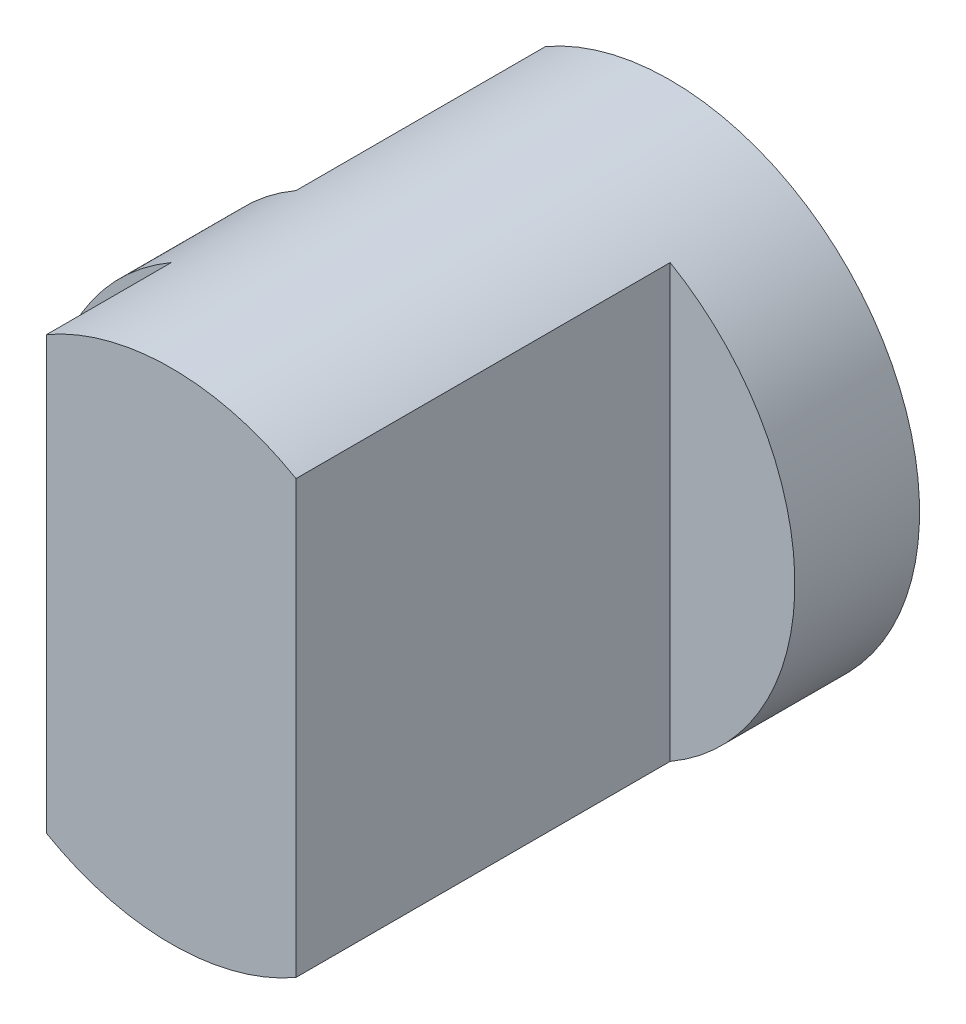
ISO-10303-21;
HEADER;
FILE_DESCRIPTION(('STEP AP214'),'2;1');
FILE_NAME('part.step','',(''),(''),'','','');
FILE_SCHEMA(('AUTOMOTIVE_DESIGN { 1 0 10303 214 1 1 1 1 }'));
ENDSEC;
DATA;
#1=APPLICATION_CONTEXT('core data for automotive mechanical design processes');
#2=APPLICATION_PROTOCOL_DEFINITION('international standard','automotive_design',2000,#1);
#3=PRODUCT_CONTEXT('',#1,'mechanical');
#4=PRODUCT('Part','Part','',(#3));
#5=PRODUCT_RELATED_PRODUCT_CATEGORY('part','',(#4));
#6=PRODUCT_DEFINITION_FORMATION('','',#4);
#7=PRODUCT_DEFINITION_CONTEXT('part definition',#1,'design');
#8=PRODUCT_DEFINITION('design','',#6,#7);
#9=PRODUCT_DEFINITION_SHAPE('','',#8);
#10=(LENGTH_UNIT() NAMED_UNIT(*) SI_UNIT(.MILLI.,.METRE.));
#11=(NAMED_UNIT(*) PLANE_ANGLE_UNIT() SI_UNIT($,.RADIAN.));
#12=(NAMED_UNIT(*) SI_UNIT($,.STERADIAN.) SOLID_ANGLE_UNIT());
#13=UNCERTAINTY_MEASURE_WITH_UNIT(LENGTH_MEASURE(1.E-05),#10,'distance_accuracy_value','');
#14=(GEOMETRIC_REPRESENTATION_CONTEXT(3) GLOBAL_UNCERTAINTY_ASSIGNED_CONTEXT((#13)) GLOBAL_UNIT_ASSIGNED_CONTEXT((#10,
#11,#12)) REPRESENTATION_CONTEXT('',''));
#15=CARTESIAN_POINT('',(0.,0.,0.));
#16=DIRECTION('',(0.,0.,1.));
#17=DIRECTION('',(1.,0.,0.));
#18=AXIS2_PLACEMENT_3D('',#15,#16,#17);
#19=CARTESIAN_POINT('',(0.,0.,4.));
#20=DIRECTION('',(0.,0.,-1.));
#21=DIRECTION('',(-1.,0.,0.));
#22=AXIS2_PLACEMENT_3D('',#19,#20,#21);
#23=CYLINDRICAL_SURFACE('',#22,2.);
#24=CARTESIAN_POINT('',(0.,0.,4.));
#25=DIRECTION('',(0.,0.,1.));
#26=DIRECTION('',(1.,0.,0.));
#27=AXIS2_PLACEMENT_3D('',#24,#25,#26);
#28=CIRCLE('',#27,2.);
#29=CARTESIAN_POINT('',(1.,1.73205080756888,4.));
#30=VERTEX_POINT('',#29);
#31=CARTESIAN_POINT('',(-1.,1.73205080756888,4.));
#32=VERTEX_POINT('',#31);
#33=EDGE_CURVE('E114',#30,#32,#28,.T.);
#34=ORIENTED_EDGE('',*,*,#33,.F.);
#35=DIRECTION('',(0.,0.,-1.));
#36=VECTOR('',#35,1.);
#37=CARTESIAN_POINT('',(1.,1.73205080756888,4.));
#38=LINE('',#37,#36);
#39=CARTESIAN_POINT('',(1.,1.73205080756888,1.));
#40=VERTEX_POINT('',#39);
#41=EDGE_CURVE('E55',#30,#40,#38,.T.);
#42=ORIENTED_EDGE('',*,*,#41,.T.);
#43=CARTESIAN_POINT('',(0.,0.,1.));
#44=DIRECTION('',(0.,0.,-1.));
#45=DIRECTION('',(-1.,0.,0.));
#46=AXIS2_PLACEMENT_3D('',#43,#44,#45);
#47=CIRCLE('',#46,2.);
#48=CARTESIAN_POINT('',(1.,-1.73205080756888,1.));
#49=VERTEX_POINT('',#48);
#50=EDGE_CURVE('E11',#40,#49,#47,.T.);
#51=ORIENTED_EDGE('',*,*,#50,.T.);
#52=DIRECTION('',(0.,0.,-1.));
#53=VECTOR('',#52,1.);
#54=CARTESIAN_POINT('',(1.,-1.73205080756888,4.));
#55=LINE('',#54,#53);
#56=CARTESIAN_POINT('',(1.,-1.73205080756888,4.));
#57=VERTEX_POINT('',#56);
#58=EDGE_CURVE('E121',#49,#57,#55,.F.);
#59=ORIENTED_EDGE('',*,*,#58,.T.);
#60=CARTESIAN_POINT('',(-1.,-1.73205080756888,4.));
#61=VERTEX_POINT('',#60);
#62=EDGE_CURVE('E117',#61,#57,#28,.T.);
#63=ORIENTED_EDGE('',*,*,#62,.F.);
#64=DIRECTION('',(0.,0.,-1.));
#65=VECTOR('',#64,1.);
#66=CARTESIAN_POINT('',(-1.,-1.73205080756888,4.));
#67=LINE('',#66,#65);
#68=CARTESIAN_POINT('',(-1.,-1.73205080756888,3.));
#69=VERTEX_POINT('',#68);
#70=EDGE_CURVE('E47',#61,#69,#67,.T.);
#71=ORIENTED_EDGE('',*,*,#70,.T.);
#72=CARTESIAN_POINT('',(0.,0.,3.));
#73=DIRECTION('',(0.,0.,-1.));
#74=DIRECTION('',(-1.,0.,0.));
#75=AXIS2_PLACEMENT_3D('',#72,#73,#74);
#76=CIRCLE('',#75,2.);
#77=CARTESIAN_POINT('',(-1.,1.73205080756888,3.));
#78=VERTEX_POINT('',#77);
#79=EDGE_CURVE('E40',#69,#78,#76,.T.);
#80=ORIENTED_EDGE('',*,*,#79,.T.);
#81=DIRECTION('',(0.,0.,-1.));
#82=VECTOR('',#81,1.);
#83=CARTESIAN_POINT('',(-1.,1.73205080756888,4.));
#84=LINE('',#83,#82);
#85=EDGE_CURVE('E98',#78,#32,#84,.F.);
#86=ORIENTED_EDGE('',*,*,#85,.T.);
#87=EDGE_LOOP('',(#34,#42,#51,#59,#63,#71,#80,#86));
#88=FACE_BOUND('',#87,.T.);
#89=CARTESIAN_POINT('',(0.,0.,2.));
#90=DIRECTION('',(0.,0.,1.));
#91=DIRECTION('',(1.,0.,0.));
#92=AXIS2_PLACEMENT_3D('',#89,#90,#91);
#93=CIRCLE('',#92,2.);
#94=CARTESIAN_POINT('',(-0.999999999999999,1.73205080756888,2.));
#95=VERTEX_POINT('',#94);
#96=CARTESIAN_POINT('',(-0.999999999999999,-1.73205080756888,2.));
#97=VERTEX_POINT('',#96);
#98=EDGE_CURVE('E103',#95,#97,#93,.T.);
#99=ORIENTED_EDGE('',*,*,#98,.T.);
#100=DIRECTION('',(0.,0.,-1.));
#101=VECTOR('',#100,1.);
#102=CARTESIAN_POINT('',(-0.999999999999997,-1.73205080756888,4.));
#103=LINE('',#102,#101);
#104=CARTESIAN_POINT('',(-1.,-1.73205080756888,0.));
#105=VERTEX_POINT('',#104);
#106=EDGE_CURVE('E87',#97,#105,#103,.T.);
#107=ORIENTED_EDGE('',*,*,#106,.T.);
#108=CARTESIAN_POINT('',(0.,0.,0.));
#109=DIRECTION('',(0.,0.,1.));
#110=DIRECTION('',(1.,0.,0.));
#111=AXIS2_PLACEMENT_3D('',#108,#109,#110);
#112=CIRCLE('',#111,2.);
#113=CARTESIAN_POINT('',(-1.,1.73205080756888,0.));
#114=VERTEX_POINT('',#113);
#115=EDGE_CURVE('E115',#105,#114,#112,.T.);
#116=ORIENTED_EDGE('',*,*,#115,.T.);
#117=DIRECTION('',(0.,0.,-1.));
#118=VECTOR('',#117,1.);
#119=CARTESIAN_POINT('',(-0.999999999999997,1.73205080756888,4.));
#120=LINE('',#119,#118);
#121=EDGE_CURVE('E99',#114,#95,#120,.F.);
#122=ORIENTED_EDGE('',*,*,#121,.T.);
#123=EDGE_LOOP('',(#99,#107,#116,#122));
#124=FACE_BOUND('',#123,.T.);
#125=ADVANCED_FACE('F33',(#88,#124),#23,.T.);
#126=CARTESIAN_POINT('',(0.,0.,4.));
#127=DIRECTION('',(0.,0.,1.));
#128=DIRECTION('',(1.,0.,0.));
#129=AXIS2_PLACEMENT_3D('',#126,#127,#128);
#130=PLANE('',#129);
#131=DIRECTION('',(0.,-1.,0.));
#132=VECTOR('',#131,1.);
#133=CARTESIAN_POINT('',(1.,0.,4.));
#134=LINE('',#133,#132);
#135=EDGE_CURVE('E106',#30,#57,#134,.T.);
#136=ORIENTED_EDGE('',*,*,#135,.F.);
#137=ORIENTED_EDGE('',*,*,#33,.T.);
#138=DIRECTION('',(0.,1.,0.));
#139=VECTOR('',#138,1.);
#140=CARTESIAN_POINT('',(-1.,0.,4.));
#141=LINE('',#140,#139);
#142=EDGE_CURVE('E109',#61,#32,#141,.T.);
#143=ORIENTED_EDGE('',*,*,#142,.F.);
#144=ORIENTED_EDGE('',*,*,#62,.T.);
#145=EDGE_LOOP('',(#136,#137,#143,#144));
#146=FACE_BOUND('',#145,.T.);
#147=ADVANCED_FACE('F138',(#146),#130,.T.);
#148=CARTESIAN_POINT('',(0.,0.,0.));
#149=DIRECTION('',(0.,0.,1.));
#150=DIRECTION('',(1.,0.,0.));
#151=AXIS2_PLACEMENT_3D('',#148,#149,#150);
#152=PLANE('',#151);
#153=ORIENTED_EDGE('',*,*,#115,.F.);
#154=DIRECTION('',(0.,1.,0.));
#155=VECTOR('',#154,1.);
#156=CARTESIAN_POINT('',(-1.,0.,0.));
#157=LINE('',#156,#155);
#158=EDGE_CURVE('E93',#105,#114,#157,.T.);
#159=ORIENTED_EDGE('',*,*,#158,.T.);
#160=EDGE_LOOP('',(#153,#159));
#161=FACE_BOUND('',#160,.T.);
#162=ADVANCED_FACE('F157',(#161),#152,.F.);
#163=CARTESIAN_POINT('',(-2.,-5.,2.));
#164=DIRECTION('',(0.,0.,1.));
#165=DIRECTION('',(1.,0.,0.));
#166=AXIS2_PLACEMENT_3D('',#163,#164,#165);
#167=PLANE('',#166);
#168=DIRECTION('',(0.,1.,0.));
#169=VECTOR('',#168,1.);
#170=CARTESIAN_POINT('',(-0.999999999999999,-5.,2.));
#171=LINE('',#170,#169);
#172=EDGE_CURVE('E90',#97,#95,#171,.T.);
#173=ORIENTED_EDGE('',*,*,#172,.F.);
#174=ORIENTED_EDGE('',*,*,#98,.F.);
#175=EDGE_LOOP('',(#173,#174));
#176=FACE_BOUND('',#175,.T.);
#177=ADVANCED_FACE('F102',(#176),#167,.F.);
#178=CARTESIAN_POINT('',(-1.,-5.,0.));
#179=DIRECTION('',(1.,0.,0.));
#180=DIRECTION('',(0.,0.,-1.));
#181=AXIS2_PLACEMENT_3D('',#178,#179,#180);
#182=PLANE('',#181);
#183=ORIENTED_EDGE('',*,*,#172,.T.);
#184=ORIENTED_EDGE('',*,*,#121,.F.);
#185=ORIENTED_EDGE('',*,*,#158,.F.);
#186=ORIENTED_EDGE('',*,*,#106,.F.);
#187=EDGE_LOOP('',(#183,#184,#185,#186));
#188=FACE_BOUND('',#187,.T.);
#189=ADVANCED_FACE('F89',(#188),#182,.F.);
#190=CARTESIAN_POINT('',(-2.,-5.,3.));
#191=DIRECTION('',(0.,0.,-1.));
#192=DIRECTION('',(-1.,0.,0.));
#193=AXIS2_PLACEMENT_3D('',#190,#191,#192);
#194=PLANE('',#193);
#195=ORIENTED_EDGE('',*,*,#79,.F.);
#196=DIRECTION('',(0.,1.,0.));
#197=VECTOR('',#196,1.);
#198=CARTESIAN_POINT('',(-1.,-5.,3.));
#199=LINE('',#198,#197);
#200=EDGE_CURVE('E104',#69,#78,#199,.T.);
#201=ORIENTED_EDGE('',*,*,#200,.T.);
#202=EDGE_LOOP('',(#195,#201));
#203=FACE_BOUND('',#202,.T.);
#204=ADVANCED_FACE('F141',(#203),#194,.F.);
#205=CARTESIAN_POINT('',(-1.,-5.,4.));
#206=DIRECTION('',(1.,0.,0.));
#207=DIRECTION('',(0.,0.,-1.));
#208=AXIS2_PLACEMENT_3D('',#205,#206,#207);
#209=PLANE('',#208);
#210=ORIENTED_EDGE('',*,*,#142,.T.);
#211=ORIENTED_EDGE('',*,*,#85,.F.);
#212=ORIENTED_EDGE('',*,*,#200,.F.);
#213=ORIENTED_EDGE('',*,*,#70,.F.);
#214=EDGE_LOOP('',(#210,#211,#212,#213));
#215=FACE_BOUND('',#214,.T.);
#216=ADVANCED_FACE('F142',(#215),#209,.F.);
#217=CARTESIAN_POINT('',(2.,-5.,1.));
#218=DIRECTION('',(0.,0.,-1.));
#219=DIRECTION('',(-1.,0.,0.));
#220=AXIS2_PLACEMENT_3D('',#217,#218,#219);
#221=PLANE('',#220);
#222=DIRECTION('',(0.,1.,0.));
#223=VECTOR('',#222,1.);
#224=CARTESIAN_POINT('',(1.,-5.,1.));
#225=LINE('',#224,#223);
#226=EDGE_CURVE('E127',#49,#40,#225,.T.);
#227=ORIENTED_EDGE('',*,*,#226,.F.);
#228=ORIENTED_EDGE('',*,*,#50,.F.);
#229=EDGE_LOOP('',(#227,#228));
#230=FACE_BOUND('',#229,.T.);
#231=ADVANCED_FACE('F144',(#230),#221,.F.);
#232=CARTESIAN_POINT('',(1.,-5.,4.));
#233=DIRECTION('',(-1.,0.,0.));
#234=DIRECTION('',(0.,0.,1.));
#235=AXIS2_PLACEMENT_3D('',#232,#233,#234);
#236=PLANE('',#235);
#237=ORIENTED_EDGE('',*,*,#135,.T.);
#238=ORIENTED_EDGE('',*,*,#58,.F.);
#239=ORIENTED_EDGE('',*,*,#226,.T.);
#240=ORIENTED_EDGE('',*,*,#41,.F.);
#241=EDGE_LOOP('',(#237,#238,#239,#240));
#242=FACE_BOUND('',#241,.T.);
#243=ADVANCED_FACE('F132',(#242),#236,.F.);
#244=CLOSED_SHELL('',(#125,#147,#162,#177,#189,#204,#216,#231,#243));
#245=MANIFOLD_SOLID_BREP('B2',#244);
#246=ADVANCED_BREP_SHAPE_REPRESENTATION('',(#18,#245),#14);
#247=SHAPE_DEFINITION_REPRESENTATION(#9,#246);
ENDSEC;
END-ISO-10303-21;
